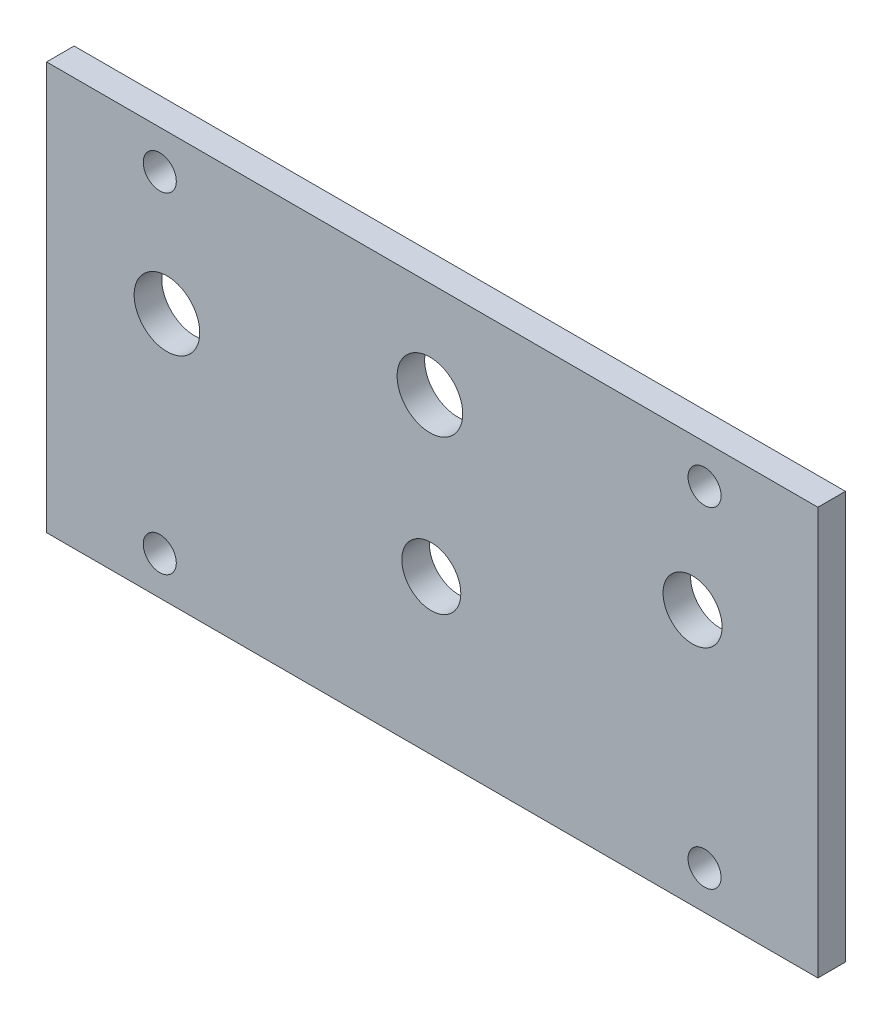
ISO-10303-21;
HEADER;
FILE_DESCRIPTION(('STEP AP214'),'2;1');
FILE_NAME('part.step','',(''),(''),'','','');
FILE_SCHEMA(('AUTOMOTIVE_DESIGN { 1 0 10303 214 1 1 1 1 }'));
ENDSEC;
DATA;
#1=APPLICATION_CONTEXT('core data for automotive mechanical design processes');
#2=APPLICATION_PROTOCOL_DEFINITION('international standard','automotive_design',2000,#1);
#3=PRODUCT_CONTEXT('',#1,'mechanical');
#4=PRODUCT('Part','Part','',(#3));
#5=PRODUCT_RELATED_PRODUCT_CATEGORY('part','',(#4));
#6=PRODUCT_DEFINITION_FORMATION('','',#4);
#7=PRODUCT_DEFINITION_CONTEXT('part definition',#1,'design');
#8=PRODUCT_DEFINITION('design','',#6,#7);
#9=PRODUCT_DEFINITION_SHAPE('','',#8);
#10=(LENGTH_UNIT() NAMED_UNIT(*) SI_UNIT(.MILLI.,.METRE.));
#11=(NAMED_UNIT(*) PLANE_ANGLE_UNIT() SI_UNIT($,.RADIAN.));
#12=(NAMED_UNIT(*) SI_UNIT($,.STERADIAN.) SOLID_ANGLE_UNIT());
#13=UNCERTAINTY_MEASURE_WITH_UNIT(LENGTH_MEASURE(1.E-05),#10,'distance_accuracy_value','');
#14=(GEOMETRIC_REPRESENTATION_CONTEXT(3) GLOBAL_UNCERTAINTY_ASSIGNED_CONTEXT((#13)) GLOBAL_UNIT_ASSIGNED_CONTEXT((#10,
#11,#12)) REPRESENTATION_CONTEXT('',''));
#15=CARTESIAN_POINT('',(0.,0.,0.));
#16=DIRECTION('',(0.,0.,1.));
#17=DIRECTION('',(1.,0.,0.));
#18=AXIS2_PLACEMENT_3D('',#15,#16,#17);
#19=CARTESIAN_POINT('',(0.,6.66750000000028,3.175));
#20=DIRECTION('',(0.,1.,0.));
#21=DIRECTION('',(0.,0.,1.));
#22=AXIS2_PLACEMENT_3D('',#19,#20,#21);
#23=PLANE('',#22);
#24=DIRECTION('',(1.,0.,0.));
#25=VECTOR('',#24,1.);
#26=CARTESIAN_POINT('',(0.,6.66750000000028,0.));
#27=LINE('',#26,#25);
#28=CARTESIAN_POINT('',(35.7259412469197,6.66750000000028,0.));
#29=VERTEX_POINT('',#28);
#30=CARTESIAN_POINT('',(124.62594124692,6.66750000000028,0.));
#31=VERTEX_POINT('',#30);
#32=EDGE_CURVE('E124',#29,#31,#27,.T.);
#33=ORIENTED_EDGE('',*,*,#32,.T.);
#34=DIRECTION('',(0.,0.,-1.));
#35=VECTOR('',#34,1.);
#36=CARTESIAN_POINT('',(124.62594124692,6.66750000000028,3.175));
#37=LINE('',#36,#35);
#38=CARTESIAN_POINT('',(124.62594124692,6.66750000000028,3.175));
#39=VERTEX_POINT('',#38);
#40=EDGE_CURVE('E11',#39,#31,#37,.T.);
#41=ORIENTED_EDGE('',*,*,#40,.F.);
#42=DIRECTION('',(1.,0.,0.));
#43=VECTOR('',#42,1.);
#44=CARTESIAN_POINT('',(0.,6.66750000000028,3.175));
#45=LINE('',#44,#43);
#46=CARTESIAN_POINT('',(35.7259412469197,6.66750000000028,3.175));
#47=VERTEX_POINT('',#46);
#48=EDGE_CURVE('E86',#47,#39,#45,.T.);
#49=ORIENTED_EDGE('',*,*,#48,.F.);
#50=DIRECTION('',(0.,0.,-1.));
#51=VECTOR('',#50,1.);
#52=CARTESIAN_POINT('',(35.7259412469197,6.66750000000028,3.175));
#53=LINE('',#52,#51);
#54=EDGE_CURVE('E52',#47,#29,#53,.T.);
#55=ORIENTED_EDGE('',*,*,#54,.T.);
#56=EDGE_LOOP('',(#33,#41,#49,#55));
#57=FACE_BOUND('',#56,.T.);
#58=ADVANCED_FACE('F36',(#57),#23,.F.);
#59=CARTESIAN_POINT('',(124.62594124692,0.,3.175));
#60=DIRECTION('',(-1.,0.,0.));
#61=DIRECTION('',(0.,-1.,0.));
#62=AXIS2_PLACEMENT_3D('',#59,#60,#61);
#63=PLANE('',#62);
#64=DIRECTION('',(0.,1.,0.));
#65=VECTOR('',#64,1.);
#66=CARTESIAN_POINT('',(124.62594124692,0.,0.));
#67=LINE('',#66,#65);
#68=CARTESIAN_POINT('',(124.62594124692,53.6575000000003,0.));
#69=VERTEX_POINT('',#68);
#70=EDGE_CURVE('E91',#31,#69,#67,.T.);
#71=ORIENTED_EDGE('',*,*,#70,.T.);
#72=DIRECTION('',(0.,0.,-1.));
#73=VECTOR('',#72,1.);
#74=CARTESIAN_POINT('',(124.62594124692,53.6575000000003,3.175));
#75=LINE('',#74,#73);
#76=CARTESIAN_POINT('',(124.62594124692,53.6575000000003,3.175));
#77=VERTEX_POINT('',#76);
#78=EDGE_CURVE('E44',#77,#69,#75,.T.);
#79=ORIENTED_EDGE('',*,*,#78,.F.);
#80=DIRECTION('',(0.,1.,0.));
#81=VECTOR('',#80,1.);
#82=CARTESIAN_POINT('',(124.62594124692,0.,3.175));
#83=LINE('',#82,#81);
#84=EDGE_CURVE('E77',#39,#77,#83,.T.);
#85=ORIENTED_EDGE('',*,*,#84,.F.);
#86=ORIENTED_EDGE('',*,*,#40,.T.);
#87=EDGE_LOOP('',(#71,#79,#85,#86));
#88=FACE_BOUND('',#87,.T.);
#89=ADVANCED_FACE('F90',(#88),#63,.F.);
#90=CARTESIAN_POINT('',(0.,53.6575000000003,3.175));
#91=DIRECTION('',(0.,1.,0.));
#92=DIRECTION('',(0.,0.,1.));
#93=AXIS2_PLACEMENT_3D('',#90,#91,#92);
#94=PLANE('',#93);
#95=DIRECTION('',(1.,0.,0.));
#96=VECTOR('',#95,1.);
#97=CARTESIAN_POINT('',(0.,53.6575000000003,0.));
#98=LINE('',#97,#96);
#99=CARTESIAN_POINT('',(35.7259412469197,53.6575000000003,0.));
#100=VERTEX_POINT('',#99);
#101=EDGE_CURVE('E127',#100,#69,#98,.T.);
#102=ORIENTED_EDGE('',*,*,#101,.F.);
#103=DIRECTION('',(0.,0.,-1.));
#104=VECTOR('',#103,1.);
#105=CARTESIAN_POINT('',(35.7259412469197,53.6575000000003,3.175));
#106=LINE('',#105,#104);
#107=CARTESIAN_POINT('',(35.7259412469197,53.6575000000003,3.175));
#108=VERTEX_POINT('',#107);
#109=EDGE_CURVE('E66',#108,#100,#106,.T.);
#110=ORIENTED_EDGE('',*,*,#109,.F.);
#111=DIRECTION('',(1.,0.,0.));
#112=VECTOR('',#111,1.);
#113=CARTESIAN_POINT('',(0.,53.6575000000003,3.175));
#114=LINE('',#113,#112);
#115=EDGE_CURVE('E85',#108,#77,#114,.T.);
#116=ORIENTED_EDGE('',*,*,#115,.T.);
#117=ORIENTED_EDGE('',*,*,#78,.T.);
#118=EDGE_LOOP('',(#102,#110,#116,#117));
#119=FACE_BOUND('',#118,.T.);
#120=ADVANCED_FACE('F94',(#119),#94,.T.);
#121=CARTESIAN_POINT('',(111.56315,49.2125000000005,3.175));
#122=DIRECTION('',(0.,0.,-1.));
#123=DIRECTION('',(-1.,0.,0.));
#124=AXIS2_PLACEMENT_3D('',#121,#122,#123);
#125=CYLINDRICAL_SURFACE('',#124,1.90499999999999);
#126=CARTESIAN_POINT('',(111.56315,49.2125000000005,3.175));
#127=DIRECTION('',(0.,0.,1.));
#128=DIRECTION('',(1.,0.,0.));
#129=AXIS2_PLACEMENT_3D('',#126,#127,#128);
#130=CIRCLE('',#129,1.90499999999999);
#131=CARTESIAN_POINT('',(113.46815,49.2125000000005,3.175));
#132=VERTEX_POINT('',#131);
#133=EDGE_CURVE('E118',#132,#132,#130,.T.);
#134=ORIENTED_EDGE('',*,*,#133,.T.);
#135=EDGE_LOOP('',(#134));
#136=FACE_BOUND('',#135,.T.);
#137=CARTESIAN_POINT('',(111.56315,49.2125000000005,0.));
#138=DIRECTION('',(0.,0.,1.));
#139=DIRECTION('',(1.,0.,0.));
#140=AXIS2_PLACEMENT_3D('',#137,#138,#139);
#141=CIRCLE('',#140,1.90499999999999);
#142=CARTESIAN_POINT('',(113.46815,49.2125000000005,0.));
#143=VERTEX_POINT('',#142);
#144=EDGE_CURVE('E150',#143,#143,#141,.T.);
#145=ORIENTED_EDGE('',*,*,#144,.F.);
#146=EDGE_LOOP('',(#145));
#147=FACE_BOUND('',#146,.T.);
#148=ADVANCED_FACE('F196',(#136,#147),#125,.F.);
#149=CARTESIAN_POINT('',(48.7743500000002,11.1125000000004,3.175));
#150=DIRECTION('',(0.,0.,-1.));
#151=DIRECTION('',(-1.,0.,0.));
#152=AXIS2_PLACEMENT_3D('',#149,#150,#151);
#153=CYLINDRICAL_SURFACE('',#152,1.90499999999999);
#154=CARTESIAN_POINT('',(48.7743500000002,11.1125000000004,3.175));
#155=DIRECTION('',(0.,0.,1.));
#156=DIRECTION('',(1.,0.,0.));
#157=AXIS2_PLACEMENT_3D('',#154,#155,#156);
#158=CIRCLE('',#157,1.90499999999999);
#159=CARTESIAN_POINT('',(50.6793500000002,11.1125000000004,3.175));
#160=VERTEX_POINT('',#159);
#161=EDGE_CURVE('E115',#160,#160,#158,.T.);
#162=ORIENTED_EDGE('',*,*,#161,.T.);
#163=EDGE_LOOP('',(#162));
#164=FACE_BOUND('',#163,.T.);
#165=CARTESIAN_POINT('',(48.7743500000002,11.1125000000004,0.));
#166=DIRECTION('',(0.,0.,1.));
#167=DIRECTION('',(1.,0.,0.));
#168=AXIS2_PLACEMENT_3D('',#165,#166,#167);
#169=CIRCLE('',#168,1.90499999999999);
#170=CARTESIAN_POINT('',(50.6793500000002,11.1125000000004,0.));
#171=VERTEX_POINT('',#170);
#172=EDGE_CURVE('E147',#171,#171,#169,.T.);
#173=ORIENTED_EDGE('',*,*,#172,.F.);
#174=EDGE_LOOP('',(#173));
#175=FACE_BOUND('',#174,.T.);
#176=ADVANCED_FACE('F198',(#164,#175),#153,.F.);
#177=CARTESIAN_POINT('',(111.56315,11.1125000000006,3.175));
#178=DIRECTION('',(0.,0.,-1.));
#179=DIRECTION('',(-1.,0.,0.));
#180=AXIS2_PLACEMENT_3D('',#177,#178,#179);
#181=CYLINDRICAL_SURFACE('',#180,1.90499999999999);
#182=CARTESIAN_POINT('',(111.56315,11.1125000000006,3.175));
#183=DIRECTION('',(0.,0.,1.));
#184=DIRECTION('',(1.,0.,0.));
#185=AXIS2_PLACEMENT_3D('',#182,#183,#184);
#186=CIRCLE('',#185,1.90499999999999);
#187=CARTESIAN_POINT('',(113.46815,11.1125000000006,3.175));
#188=VERTEX_POINT('',#187);
#189=EDGE_CURVE('E112',#188,#188,#186,.T.);
#190=ORIENTED_EDGE('',*,*,#189,.T.);
#191=EDGE_LOOP('',(#190));
#192=FACE_BOUND('',#191,.T.);
#193=CARTESIAN_POINT('',(111.56315,11.1125000000006,0.));
#194=DIRECTION('',(0.,0.,1.));
#195=DIRECTION('',(1.,0.,0.));
#196=AXIS2_PLACEMENT_3D('',#193,#194,#195);
#197=CIRCLE('',#196,1.90499999999999);
#198=CARTESIAN_POINT('',(113.46815,11.1125000000006,0.));
#199=VERTEX_POINT('',#198);
#200=EDGE_CURVE('E144',#199,#199,#197,.T.);
#201=ORIENTED_EDGE('',*,*,#200,.F.);
#202=EDGE_LOOP('',(#201));
#203=FACE_BOUND('',#202,.T.);
#204=ADVANCED_FACE('F204',(#192,#203),#181,.F.);
#205=CARTESIAN_POINT('',(80.0694064466988,24.4520759001325,3.175));
#206=DIRECTION('',(0.,0.,-1.));
#207=DIRECTION('',(-1.,0.,0.));
#208=AXIS2_PLACEMENT_3D('',#205,#206,#207);
#209=CYLINDRICAL_SURFACE('',#208,3.4);
#210=CARTESIAN_POINT('',(80.0694064466988,24.4520759001325,3.175));
#211=DIRECTION('',(0.,0.,1.));
#212=DIRECTION('',(1.,0.,0.));
#213=AXIS2_PLACEMENT_3D('',#210,#211,#212);
#214=CIRCLE('',#213,3.4);
#215=CARTESIAN_POINT('',(83.4694064466988,24.4520759001325,3.175));
#216=VERTEX_POINT('',#215);
#217=EDGE_CURVE('E109',#216,#216,#214,.T.);
#218=ORIENTED_EDGE('',*,*,#217,.T.);
#219=EDGE_LOOP('',(#218));
#220=FACE_BOUND('',#219,.T.);
#221=CARTESIAN_POINT('',(80.0694064466988,24.4520759001325,0.));
#222=DIRECTION('',(0.,0.,1.));
#223=DIRECTION('',(1.,0.,0.));
#224=AXIS2_PLACEMENT_3D('',#221,#222,#223);
#225=CIRCLE('',#224,3.4);
#226=CARTESIAN_POINT('',(83.4694064466988,24.4520759001325,0.));
#227=VERTEX_POINT('',#226);
#228=EDGE_CURVE('E141',#227,#227,#225,.T.);
#229=ORIENTED_EDGE('',*,*,#228,.F.);
#230=EDGE_LOOP('',(#229));
#231=FACE_BOUND('',#230,.T.);
#232=ADVANCED_FACE('F211',(#220,#231),#209,.F.);
#233=CARTESIAN_POINT('',(110.18092088785,36.1848709811177,3.175));
#234=DIRECTION('',(0.,0.,-1.));
#235=DIRECTION('',(-1.,0.,0.));
#236=AXIS2_PLACEMENT_3D('',#233,#234,#235);
#237=CYLINDRICAL_SURFACE('',#236,3.4);
#238=CARTESIAN_POINT('',(110.18092088785,36.1848709811177,3.175));
#239=DIRECTION('',(0.,0.,1.));
#240=DIRECTION('',(1.,0.,0.));
#241=AXIS2_PLACEMENT_3D('',#238,#239,#240);
#242=CIRCLE('',#241,3.4);
#243=CARTESIAN_POINT('',(113.58092088785,36.1848709811177,3.175));
#244=VERTEX_POINT('',#243);
#245=EDGE_CURVE('E106',#244,#244,#242,.T.);
#246=ORIENTED_EDGE('',*,*,#245,.T.);
#247=EDGE_LOOP('',(#246));
#248=FACE_BOUND('',#247,.T.);
#249=CARTESIAN_POINT('',(110.18092088785,36.1848709811177,0.));
#250=DIRECTION('',(0.,0.,1.));
#251=DIRECTION('',(1.,0.,0.));
#252=AXIS2_PLACEMENT_3D('',#249,#250,#251);
#253=CIRCLE('',#252,3.4);
#254=CARTESIAN_POINT('',(113.58092088785,36.1848709811177,0.));
#255=VERTEX_POINT('',#254);
#256=EDGE_CURVE('E138',#255,#255,#253,.T.);
#257=ORIENTED_EDGE('',*,*,#256,.F.);
#258=EDGE_LOOP('',(#257));
#259=FACE_BOUND('',#258,.T.);
#260=ADVANCED_FACE('F215',(#248,#259),#237,.F.);
#261=CARTESIAN_POINT('',(49.6009684163521,35.458841184411,3.175));
#262=DIRECTION('',(0.,0.,-1.));
#263=DIRECTION('',(-1.,0.,0.));
#264=AXIS2_PLACEMENT_3D('',#261,#262,#263);
#265=CYLINDRICAL_SURFACE('',#264,3.781);
#266=CARTESIAN_POINT('',(49.6009684163521,35.458841184411,3.175));
#267=DIRECTION('',(0.,0.,1.));
#268=DIRECTION('',(1.,0.,0.));
#269=AXIS2_PLACEMENT_3D('',#266,#267,#268);
#270=CIRCLE('',#269,3.781);
#271=CARTESIAN_POINT('',(53.3819684163521,35.458841184411,3.175));
#272=VERTEX_POINT('',#271);
#273=EDGE_CURVE('E103',#272,#272,#270,.T.);
#274=ORIENTED_EDGE('',*,*,#273,.T.);
#275=EDGE_LOOP('',(#274));
#276=FACE_BOUND('',#275,.T.);
#277=CARTESIAN_POINT('',(49.6009684163521,35.458841184411,0.));
#278=DIRECTION('',(0.,0.,1.));
#279=DIRECTION('',(1.,0.,0.));
#280=AXIS2_PLACEMENT_3D('',#277,#278,#279);
#281=CIRCLE('',#280,3.781);
#282=CARTESIAN_POINT('',(53.3819684163521,35.458841184411,0.));
#283=VERTEX_POINT('',#282);
#284=EDGE_CURVE('E135',#283,#283,#281,.T.);
#285=ORIENTED_EDGE('',*,*,#284,.F.);
#286=EDGE_LOOP('',(#285));
#287=FACE_BOUND('',#286,.T.);
#288=ADVANCED_FACE('F219',(#276,#287),#265,.F.);
#289=CARTESIAN_POINT('',(79.908808953719,42.5096143219425,3.175));
#290=DIRECTION('',(0.,0.,-1.));
#291=DIRECTION('',(-1.,0.,0.));
#292=AXIS2_PLACEMENT_3D('',#289,#290,#291);
#293=CYLINDRICAL_SURFACE('',#292,3.78100000000001);
#294=CARTESIAN_POINT('',(79.908808953719,42.5096143219425,3.175));
#295=DIRECTION('',(0.,0.,1.));
#296=DIRECTION('',(1.,0.,0.));
#297=AXIS2_PLACEMENT_3D('',#294,#295,#296);
#298=CIRCLE('',#297,3.78100000000001);
#299=CARTESIAN_POINT('',(83.689808953719,42.5096143219425,3.175));
#300=VERTEX_POINT('',#299);
#301=EDGE_CURVE('E97',#300,#300,#298,.T.);
#302=ORIENTED_EDGE('',*,*,#301,.T.);
#303=EDGE_LOOP('',(#302));
#304=FACE_BOUND('',#303,.T.);
#305=CARTESIAN_POINT('',(79.908808953719,42.5096143219425,0.));
#306=DIRECTION('',(0.,0.,1.));
#307=DIRECTION('',(1.,0.,0.));
#308=AXIS2_PLACEMENT_3D('',#305,#306,#307);
#309=CIRCLE('',#308,3.78100000000001);
#310=CARTESIAN_POINT('',(83.689808953719,42.5096143219425,0.));
#311=VERTEX_POINT('',#310);
#312=EDGE_CURVE('E132',#311,#311,#309,.T.);
#313=ORIENTED_EDGE('',*,*,#312,.F.);
#314=EDGE_LOOP('',(#313));
#315=FACE_BOUND('',#314,.T.);
#316=ADVANCED_FACE('F171',(#304,#315),#293,.F.);
#317=CARTESIAN_POINT('',(35.7259412469197,0.,3.175));
#318=DIRECTION('',(-1.,0.,0.));
#319=DIRECTION('',(0.,0.,1.));
#320=AXIS2_PLACEMENT_3D('',#317,#318,#319);
#321=PLANE('',#320);
#322=DIRECTION('',(0.,1.,0.));
#323=VECTOR('',#322,1.);
#324=CARTESIAN_POINT('',(35.7259412469197,0.,0.));
#325=LINE('',#324,#323);
#326=EDGE_CURVE('E129',#29,#100,#325,.T.);
#327=ORIENTED_EDGE('',*,*,#326,.F.);
#328=ORIENTED_EDGE('',*,*,#54,.F.);
#329=DIRECTION('',(0.,1.,0.));
#330=VECTOR('',#329,1.);
#331=CARTESIAN_POINT('',(35.7259412469197,0.,3.175));
#332=LINE('',#331,#330);
#333=EDGE_CURVE('E95',#47,#108,#332,.T.);
#334=ORIENTED_EDGE('',*,*,#333,.T.);
#335=ORIENTED_EDGE('',*,*,#109,.T.);
#336=EDGE_LOOP('',(#327,#328,#334,#335));
#337=FACE_BOUND('',#336,.T.);
#338=ADVANCED_FACE('F163',(#337),#321,.T.);
#339=CARTESIAN_POINT('',(48.7743500000001,49.2125000000004,3.175));
#340=DIRECTION('',(0.,0.,-1.));
#341=DIRECTION('',(-1.,0.,0.));
#342=AXIS2_PLACEMENT_3D('',#339,#340,#341);
#343=CYLINDRICAL_SURFACE('',#342,1.90499999999999);
#344=CARTESIAN_POINT('',(48.7743500000001,49.2125000000004,3.175));
#345=DIRECTION('',(0.,0.,1.));
#346=DIRECTION('',(1.,0.,0.));
#347=AXIS2_PLACEMENT_3D('',#344,#345,#346);
#348=CIRCLE('',#347,1.90499999999999);
#349=CARTESIAN_POINT('',(50.6793500000001,49.2125000000004,3.175));
#350=VERTEX_POINT('',#349);
#351=EDGE_CURVE('E121',#350,#350,#348,.T.);
#352=ORIENTED_EDGE('',*,*,#351,.T.);
#353=EDGE_LOOP('',(#352));
#354=FACE_BOUND('',#353,.T.);
#355=CARTESIAN_POINT('',(48.7743500000001,49.2125000000004,0.));
#356=DIRECTION('',(0.,0.,1.));
#357=DIRECTION('',(1.,0.,0.));
#358=AXIS2_PLACEMENT_3D('',#355,#356,#357);
#359=CIRCLE('',#358,1.90499999999999);
#360=CARTESIAN_POINT('',(50.6793500000001,49.2125000000004,0.));
#361=VERTEX_POINT('',#360);
#362=EDGE_CURVE('E153',#361,#361,#359,.T.);
#363=ORIENTED_EDGE('',*,*,#362,.F.);
#364=EDGE_LOOP('',(#363));
#365=FACE_BOUND('',#364,.T.);
#366=ADVANCED_FACE('F161',(#354,#365),#343,.F.);
#367=CARTESIAN_POINT('',(0.,0.,3.175));
#368=DIRECTION('',(0.,0.,1.));
#369=DIRECTION('',(1.,0.,0.));
#370=AXIS2_PLACEMENT_3D('',#367,#368,#369);
#371=PLANE('',#370);
#372=ORIENTED_EDGE('',*,*,#48,.T.);
#373=ORIENTED_EDGE('',*,*,#84,.T.);
#374=ORIENTED_EDGE('',*,*,#115,.F.);
#375=ORIENTED_EDGE('',*,*,#333,.F.);
#376=EDGE_LOOP('',(#372,#373,#374,#375));
#377=FACE_BOUND('',#376,.T.);
#378=ORIENTED_EDGE('',*,*,#301,.F.);
#379=EDGE_LOOP('',(#378));
#380=FACE_BOUND('',#379,.T.);
#381=ORIENTED_EDGE('',*,*,#273,.F.);
#382=EDGE_LOOP('',(#381));
#383=FACE_BOUND('',#382,.T.);
#384=ORIENTED_EDGE('',*,*,#245,.F.);
#385=EDGE_LOOP('',(#384));
#386=FACE_BOUND('',#385,.T.);
#387=ORIENTED_EDGE('',*,*,#217,.F.);
#388=EDGE_LOOP('',(#387));
#389=FACE_BOUND('',#388,.T.);
#390=ORIENTED_EDGE('',*,*,#189,.F.);
#391=EDGE_LOOP('',(#390));
#392=FACE_BOUND('',#391,.T.);
#393=ORIENTED_EDGE('',*,*,#161,.F.);
#394=EDGE_LOOP('',(#393));
#395=FACE_BOUND('',#394,.T.);
#396=ORIENTED_EDGE('',*,*,#133,.F.);
#397=EDGE_LOOP('',(#396));
#398=FACE_BOUND('',#397,.T.);
#399=ORIENTED_EDGE('',*,*,#351,.F.);
#400=EDGE_LOOP('',(#399));
#401=FACE_BOUND('',#400,.T.);
#402=ADVANCED_FACE('F81',(#377,#380,#383,#386,#389,#392,#395,#398,#401),#371,.T.);
#403=CARTESIAN_POINT('',(0.,0.,0.));
#404=DIRECTION('',(0.,0.,1.));
#405=DIRECTION('',(1.,0.,0.));
#406=AXIS2_PLACEMENT_3D('',#403,#404,#405);
#407=PLANE('',#406);
#408=ORIENTED_EDGE('',*,*,#32,.F.);
#409=ORIENTED_EDGE('',*,*,#326,.T.);
#410=ORIENTED_EDGE('',*,*,#101,.T.);
#411=ORIENTED_EDGE('',*,*,#70,.F.);
#412=EDGE_LOOP('',(#408,#409,#410,#411));
#413=FACE_BOUND('',#412,.T.);
#414=ORIENTED_EDGE('',*,*,#312,.T.);
#415=EDGE_LOOP('',(#414));
#416=FACE_BOUND('',#415,.T.);
#417=ORIENTED_EDGE('',*,*,#284,.T.);
#418=EDGE_LOOP('',(#417));
#419=FACE_BOUND('',#418,.T.);
#420=ORIENTED_EDGE('',*,*,#256,.T.);
#421=EDGE_LOOP('',(#420));
#422=FACE_BOUND('',#421,.T.);
#423=ORIENTED_EDGE('',*,*,#228,.T.);
#424=EDGE_LOOP('',(#423));
#425=FACE_BOUND('',#424,.T.);
#426=ORIENTED_EDGE('',*,*,#200,.T.);
#427=EDGE_LOOP('',(#426));
#428=FACE_BOUND('',#427,.T.);
#429=ORIENTED_EDGE('',*,*,#172,.T.);
#430=EDGE_LOOP('',(#429));
#431=FACE_BOUND('',#430,.T.);
#432=ORIENTED_EDGE('',*,*,#144,.T.);
#433=EDGE_LOOP('',(#432));
#434=FACE_BOUND('',#433,.T.);
#435=ORIENTED_EDGE('',*,*,#362,.T.);
#436=EDGE_LOOP('',(#435));
#437=FACE_BOUND('',#436,.T.);
#438=ADVANCED_FACE('F159',(#413,#416,#419,#422,#425,#428,#431,#434,#437),#407,.F.);
#439=CLOSED_SHELL('',(#58,#89,#120,#148,#176,#204,#232,#260,#288,#316,#338,#366,#402,#438));
#440=MANIFOLD_SOLID_BREP('B2',#439);
#441=ADVANCED_BREP_SHAPE_REPRESENTATION('',(#18,#440),#14);
#442=SHAPE_DEFINITION_REPRESENTATION(#9,#441);
ENDSEC;
END-ISO-10303-21;
